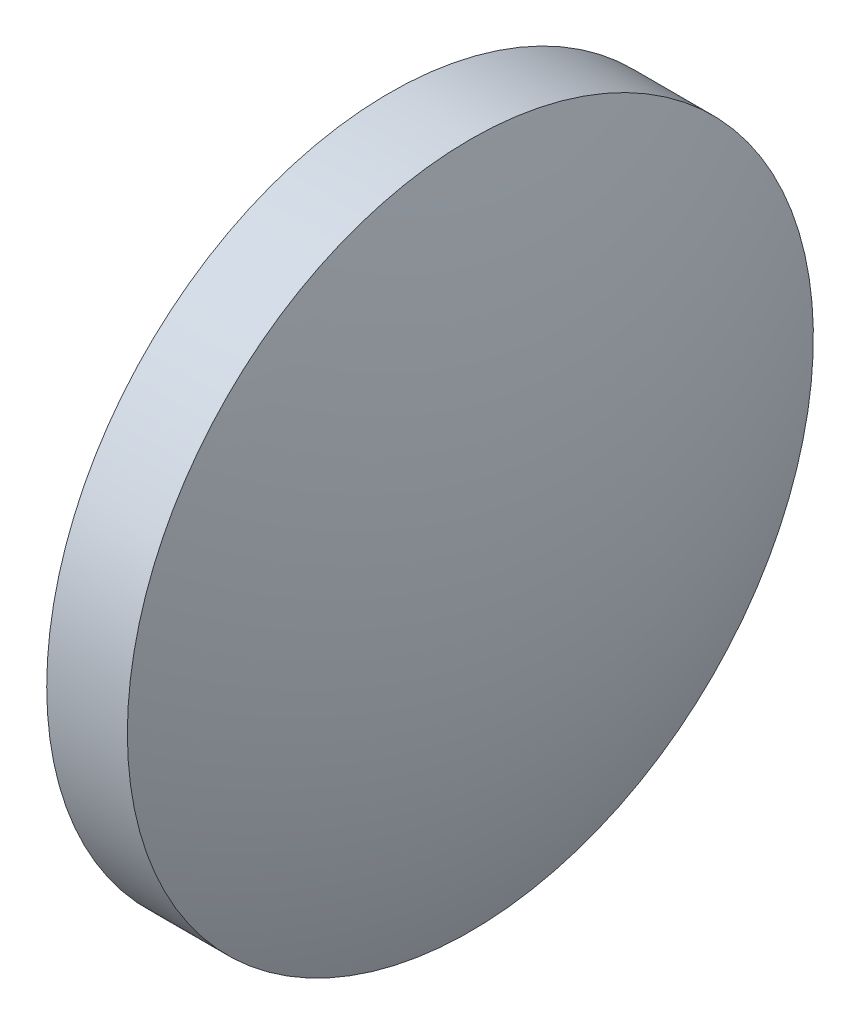
ISO-10303-21;
HEADER;
FILE_DESCRIPTION(('STEP AP214'),'2;1');
FILE_NAME('part.step','',(''),(''),'','','');
FILE_SCHEMA(('AUTOMOTIVE_DESIGN { 1 0 10303 214 1 1 1 1 }'));
ENDSEC;
DATA;
#1=APPLICATION_CONTEXT('core data for automotive mechanical design processes');
#2=APPLICATION_PROTOCOL_DEFINITION('international standard','automotive_design',2000,#1);
#3=PRODUCT_CONTEXT('',#1,'mechanical');
#4=PRODUCT('Part','Part','',(#3));
#5=PRODUCT_RELATED_PRODUCT_CATEGORY('part','',(#4));
#6=PRODUCT_DEFINITION_FORMATION('','',#4);
#7=PRODUCT_DEFINITION_CONTEXT('part definition',#1,'design');
#8=PRODUCT_DEFINITION('design','',#6,#7);
#9=PRODUCT_DEFINITION_SHAPE('','',#8);
#10=(LENGTH_UNIT() NAMED_UNIT(*) SI_UNIT(.MILLI.,.METRE.));
#11=(NAMED_UNIT(*) PLANE_ANGLE_UNIT() SI_UNIT($,.RADIAN.));
#12=(NAMED_UNIT(*) SI_UNIT($,.STERADIAN.) SOLID_ANGLE_UNIT());
#13=UNCERTAINTY_MEASURE_WITH_UNIT(LENGTH_MEASURE(1.E-05),#10,'distance_accuracy_value','');
#14=(GEOMETRIC_REPRESENTATION_CONTEXT(3) GLOBAL_UNCERTAINTY_ASSIGNED_CONTEXT((#13)) GLOBAL_UNIT_ASSIGNED_CONTEXT((#10,
#11,#12)) REPRESENTATION_CONTEXT('',''));
#15=CARTESIAN_POINT('',(0.,0.,0.));
#16=DIRECTION('',(0.,0.,1.));
#17=DIRECTION('',(1.,0.,0.));
#18=AXIS2_PLACEMENT_3D('',#15,#16,#17);
#19=CARTESIAN_POINT('',(86.6756064308381,65.2335549264122,0.));
#20=DIRECTION('',(-1.,0.,0.));
#21=DIRECTION('',(0.,1.,0.));
#22=AXIS2_PLACEMENT_3D('',#19,#20,#21);
#23=SPHERICAL_SURFACE('',#22,34.506);
#24=CARTESIAN_POINT('',(118.759465862023,65.2335549264122,0.));
#25=DIRECTION('',(-1.,0.,0.));
#26=DIRECTION('',(0.,0.,1.));
#27=AXIS2_PLACEMENT_3D('',#24,#25,#26);
#28=CIRCLE('',#27,12.7);
#29=CARTESIAN_POINT('',(118.759465862023,65.2335549264122,12.7));
#30=VERTEX_POINT('',#29);
#31=EDGE_CURVE('E10',#30,#30,#28,.T.);
#32=ORIENTED_EDGE('',*,*,#31,.F.);
#33=EDGE_LOOP('',(#32));
#34=FACE_BOUND('',#33,.T.);
#35=ADVANCED_FACE('F35',(#34),#23,.T.);
#36=CARTESIAN_POINT('',(110.165373228488,65.2335549264122,0.));
#37=DIRECTION('',(-1.,0.,0.));
#38=DIRECTION('',(0.,0.,1.));
#39=AXIS2_PLACEMENT_3D('',#36,#37,#38);
#40=CYLINDRICAL_SURFACE('',#39,12.7);
#41=CARTESIAN_POINT('',(115.773606430838,65.2335549264122,0.));
#42=DIRECTION('',(-1.,0.,0.));
#43=DIRECTION('',(0.,0.,1.));
#44=AXIS2_PLACEMENT_3D('',#41,#42,#43);
#45=CIRCLE('',#44,12.7);
#46=CARTESIAN_POINT('',(115.773606430838,65.2335549264122,12.7));
#47=VERTEX_POINT('',#46);
#48=EDGE_CURVE('E41',#47,#47,#45,.T.);
#49=ORIENTED_EDGE('',*,*,#48,.F.);
#50=EDGE_LOOP('',(#49));
#51=FACE_BOUND('',#50,.T.);
#52=ORIENTED_EDGE('',*,*,#31,.T.);
#53=EDGE_LOOP('',(#52));
#54=FACE_BOUND('',#53,.T.);
#55=ADVANCED_FACE('F49',(#51,#54),#40,.T.);
#56=CARTESIAN_POINT('',(115.773606430838,65.2335549264122,0.));
#57=DIRECTION('',(1.,0.,0.));
#58=DIRECTION('',(0.,0.,-1.));
#59=AXIS2_PLACEMENT_3D('',#56,#57,#58);
#60=PLANE('',#59);
#61=ORIENTED_EDGE('',*,*,#48,.T.);
#62=EDGE_LOOP('',(#61));
#63=FACE_BOUND('',#62,.T.);
#64=ADVANCED_FACE('F47',(#63),#60,.F.);
#65=CLOSED_SHELL('',(#35,#55,#64));
#66=MANIFOLD_SOLID_BREP('B2',#65);
#67=ADVANCED_BREP_SHAPE_REPRESENTATION('',(#18,#66),#14);
#68=SHAPE_DEFINITION_REPRESENTATION(#9,#67);
ENDSEC;
END-ISO-10303-21;
